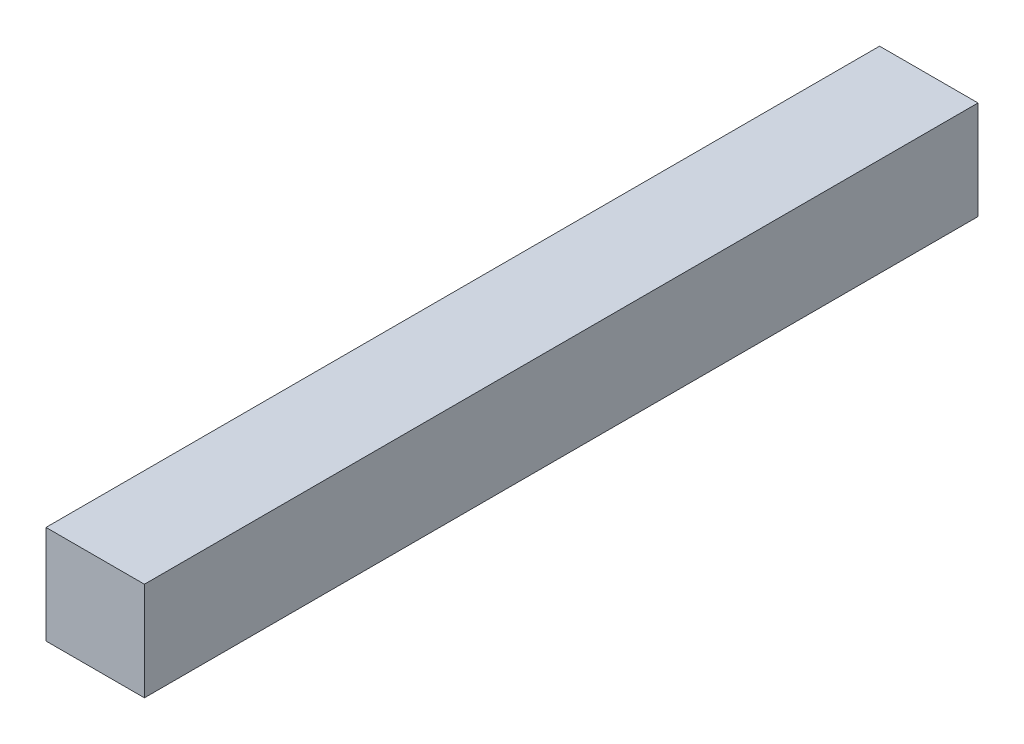
ISO-10303-21;
HEADER;
FILE_DESCRIPTION(('STEP AP214'),'2;1');
FILE_NAME('part.step','',(''),(''),'','','');
FILE_SCHEMA(('AUTOMOTIVE_DESIGN { 1 0 10303 214 1 1 1 1 }'));
ENDSEC;
DATA;
#1=APPLICATION_CONTEXT('core data for automotive mechanical design processes');
#2=APPLICATION_PROTOCOL_DEFINITION('international standard','automotive_design',2000,#1);
#3=PRODUCT_CONTEXT('',#1,'mechanical');
#4=PRODUCT('Part','Part','',(#3));
#5=PRODUCT_RELATED_PRODUCT_CATEGORY('part','',(#4));
#6=PRODUCT_DEFINITION_FORMATION('','',#4);
#7=PRODUCT_DEFINITION_CONTEXT('part definition',#1,'design');
#8=PRODUCT_DEFINITION('design','',#6,#7);
#9=PRODUCT_DEFINITION_SHAPE('','',#8);
#10=(LENGTH_UNIT() NAMED_UNIT(*) SI_UNIT(.MILLI.,.METRE.));
#11=(NAMED_UNIT(*) PLANE_ANGLE_UNIT() SI_UNIT($,.RADIAN.));
#12=(NAMED_UNIT(*) SI_UNIT($,.STERADIAN.) SOLID_ANGLE_UNIT());
#13=UNCERTAINTY_MEASURE_WITH_UNIT(LENGTH_MEASURE(1.E-05),#10,'distance_accuracy_value','');
#14=(GEOMETRIC_REPRESENTATION_CONTEXT(3) GLOBAL_UNCERTAINTY_ASSIGNED_CONTEXT((#13)) GLOBAL_UNIT_ASSIGNED_CONTEXT((#10,
#11,#12)) REPRESENTATION_CONTEXT('',''));
#15=CARTESIAN_POINT('',(0.,0.,0.));
#16=DIRECTION('',(0.,0.,1.));
#17=DIRECTION('',(1.,0.,0.));
#18=AXIS2_PLACEMENT_3D('',#15,#16,#17);
#19=CARTESIAN_POINT('',(0.,0.,25.41));
#20=DIRECTION('',(1.,0.,0.));
#21=DIRECTION('',(0.,0.,-1.));
#22=AXIS2_PLACEMENT_3D('',#19,#20,#21);
#23=PLANE('',#22);
#24=DIRECTION('',(0.,-1.,0.));
#25=VECTOR('',#24,1.);
#26=CARTESIAN_POINT('',(0.,0.,0.));
#27=LINE('',#26,#25);
#28=CARTESIAN_POINT('',(0.,3.,0.));
#29=VERTEX_POINT('',#28);
#30=CARTESIAN_POINT('',(0.,0.,0.));
#31=VERTEX_POINT('',#30);
#32=EDGE_CURVE('E97',#29,#31,#27,.T.);
#33=ORIENTED_EDGE('',*,*,#32,.T.);
#34=DIRECTION('',(0.,0.,-1.));
#35=VECTOR('',#34,1.);
#36=CARTESIAN_POINT('',(0.,0.,25.41));
#37=LINE('',#36,#35);
#38=CARTESIAN_POINT('',(0.,0.,25.41));
#39=VERTEX_POINT('',#38);
#40=EDGE_CURVE('E11',#39,#31,#37,.T.);
#41=ORIENTED_EDGE('',*,*,#40,.F.);
#42=DIRECTION('',(0.,-1.,0.));
#43=VECTOR('',#42,1.);
#44=CARTESIAN_POINT('',(0.,0.,25.41));
#45=LINE('',#44,#43);
#46=CARTESIAN_POINT('',(0.,3.,25.41));
#47=VERTEX_POINT('',#46);
#48=EDGE_CURVE('E85',#47,#39,#45,.T.);
#49=ORIENTED_EDGE('',*,*,#48,.F.);
#50=DIRECTION('',(0.,0.,-1.));
#51=VECTOR('',#50,1.);
#52=CARTESIAN_POINT('',(0.,3.,25.41));
#53=LINE('',#52,#51);
#54=EDGE_CURVE('E93',#47,#29,#53,.T.);
#55=ORIENTED_EDGE('',*,*,#54,.T.);
#56=EDGE_LOOP('',(#33,#41,#49,#55));
#57=FACE_BOUND('',#56,.T.);
#58=ADVANCED_FACE('F34',(#57),#23,.F.);
#59=CARTESIAN_POINT('',(0.,0.,25.41));
#60=DIRECTION('',(0.,1.,0.));
#61=DIRECTION('',(0.,0.,1.));
#62=AXIS2_PLACEMENT_3D('',#59,#60,#61);
#63=PLANE('',#62);
#64=DIRECTION('',(1.,0.,0.));
#65=VECTOR('',#64,1.);
#66=CARTESIAN_POINT('',(0.,0.,0.));
#67=LINE('',#66,#65);
#68=CARTESIAN_POINT('',(3.,0.,0.));
#69=VERTEX_POINT('',#68);
#70=EDGE_CURVE('E89',#31,#69,#67,.T.);
#71=ORIENTED_EDGE('',*,*,#70,.T.);
#72=DIRECTION('',(0.,0.,-1.));
#73=VECTOR('',#72,1.);
#74=CARTESIAN_POINT('',(3.,0.,25.41));
#75=LINE('',#74,#73);
#76=CARTESIAN_POINT('',(3.,0.,25.41));
#77=VERTEX_POINT('',#76);
#78=EDGE_CURVE('E42',#77,#69,#75,.T.);
#79=ORIENTED_EDGE('',*,*,#78,.F.);
#80=DIRECTION('',(1.,0.,0.));
#81=VECTOR('',#80,1.);
#82=CARTESIAN_POINT('',(0.,0.,25.41));
#83=LINE('',#82,#81);
#84=EDGE_CURVE('E80',#39,#77,#83,.T.);
#85=ORIENTED_EDGE('',*,*,#84,.F.);
#86=ORIENTED_EDGE('',*,*,#40,.T.);
#87=EDGE_LOOP('',(#71,#79,#85,#86));
#88=FACE_BOUND('',#87,.T.);
#89=ADVANCED_FACE('F88',(#88),#63,.F.);
#90=CARTESIAN_POINT('',(3.,0.,25.41));
#91=DIRECTION('',(-1.,0.,0.));
#92=DIRECTION('',(0.,0.,1.));
#93=AXIS2_PLACEMENT_3D('',#90,#91,#92);
#94=PLANE('',#93);
#95=DIRECTION('',(0.,1.,0.));
#96=VECTOR('',#95,1.);
#97=CARTESIAN_POINT('',(3.,0.,0.));
#98=LINE('',#97,#96);
#99=CARTESIAN_POINT('',(3.,3.,0.));
#100=VERTEX_POINT('',#99);
#101=EDGE_CURVE('E67',#69,#100,#98,.T.);
#102=ORIENTED_EDGE('',*,*,#101,.T.);
#103=DIRECTION('',(0.,0.,-1.));
#104=VECTOR('',#103,1.);
#105=CARTESIAN_POINT('',(3.,3.,25.41));
#106=LINE('',#105,#104);
#107=CARTESIAN_POINT('',(3.,3.,25.41));
#108=VERTEX_POINT('',#107);
#109=EDGE_CURVE('E90',#108,#100,#106,.T.);
#110=ORIENTED_EDGE('',*,*,#109,.F.);
#111=DIRECTION('',(0.,1.,0.));
#112=VECTOR('',#111,1.);
#113=CARTESIAN_POINT('',(3.,0.,25.41));
#114=LINE('',#113,#112);
#115=EDGE_CURVE('E83',#77,#108,#114,.T.);
#116=ORIENTED_EDGE('',*,*,#115,.F.);
#117=ORIENTED_EDGE('',*,*,#78,.T.);
#118=EDGE_LOOP('',(#102,#110,#116,#117));
#119=FACE_BOUND('',#118,.T.);
#120=ADVANCED_FACE('F91',(#119),#94,.F.);
#121=CARTESIAN_POINT('',(0.,3.,25.41));
#122=DIRECTION('',(0.,-1.,0.));
#123=DIRECTION('',(0.,0.,-1.));
#124=AXIS2_PLACEMENT_3D('',#121,#122,#123);
#125=PLANE('',#124);
#126=DIRECTION('',(-1.,0.,0.));
#127=VECTOR('',#126,1.);
#128=CARTESIAN_POINT('',(0.,3.,0.));
#129=LINE('',#128,#127);
#130=EDGE_CURVE('E73',#100,#29,#129,.T.);
#131=ORIENTED_EDGE('',*,*,#130,.T.);
#132=ORIENTED_EDGE('',*,*,#54,.F.);
#133=DIRECTION('',(-1.,0.,0.));
#134=VECTOR('',#133,1.);
#135=CARTESIAN_POINT('',(0.,3.,25.41));
#136=LINE('',#135,#134);
#137=EDGE_CURVE('E50',#108,#47,#136,.T.);
#138=ORIENTED_EDGE('',*,*,#137,.F.);
#139=ORIENTED_EDGE('',*,*,#109,.T.);
#140=EDGE_LOOP('',(#131,#132,#138,#139));
#141=FACE_BOUND('',#140,.T.);
#142=ADVANCED_FACE('F104',(#141),#125,.F.);
#143=CARTESIAN_POINT('',(0.,0.,25.41));
#144=DIRECTION('',(0.,0.,-1.));
#145=DIRECTION('',(-1.,0.,0.));
#146=AXIS2_PLACEMENT_3D('',#143,#144,#145);
#147=PLANE('',#146);
#148=ORIENTED_EDGE('',*,*,#48,.T.);
#149=ORIENTED_EDGE('',*,*,#84,.T.);
#150=ORIENTED_EDGE('',*,*,#115,.T.);
#151=ORIENTED_EDGE('',*,*,#137,.T.);
#152=EDGE_LOOP('',(#148,#149,#150,#151));
#153=FACE_BOUND('',#152,.T.);
#154=ADVANCED_FACE('F81',(#153),#147,.F.);
#155=CARTESIAN_POINT('',(0.,0.,0.));
#156=DIRECTION('',(0.,0.,-1.));
#157=DIRECTION('',(-1.,0.,0.));
#158=AXIS2_PLACEMENT_3D('',#155,#156,#157);
#159=PLANE('',#158);
#160=ORIENTED_EDGE('',*,*,#32,.F.);
#161=ORIENTED_EDGE('',*,*,#130,.F.);
#162=ORIENTED_EDGE('',*,*,#101,.F.);
#163=ORIENTED_EDGE('',*,*,#70,.F.);
#164=EDGE_LOOP('',(#160,#161,#162,#163));
#165=FACE_BOUND('',#164,.T.);
#166=ADVANCED_FACE('F107',(#165),#159,.T.);
#167=CLOSED_SHELL('',(#58,#89,#120,#142,#154,#166));
#168=MANIFOLD_SOLID_BREP('B2',#167);
#169=ADVANCED_BREP_SHAPE_REPRESENTATION('',(#18,#168),#14);
#170=SHAPE_DEFINITION_REPRESENTATION(#9,#169);
ENDSEC;
END-ISO-10303-21;
